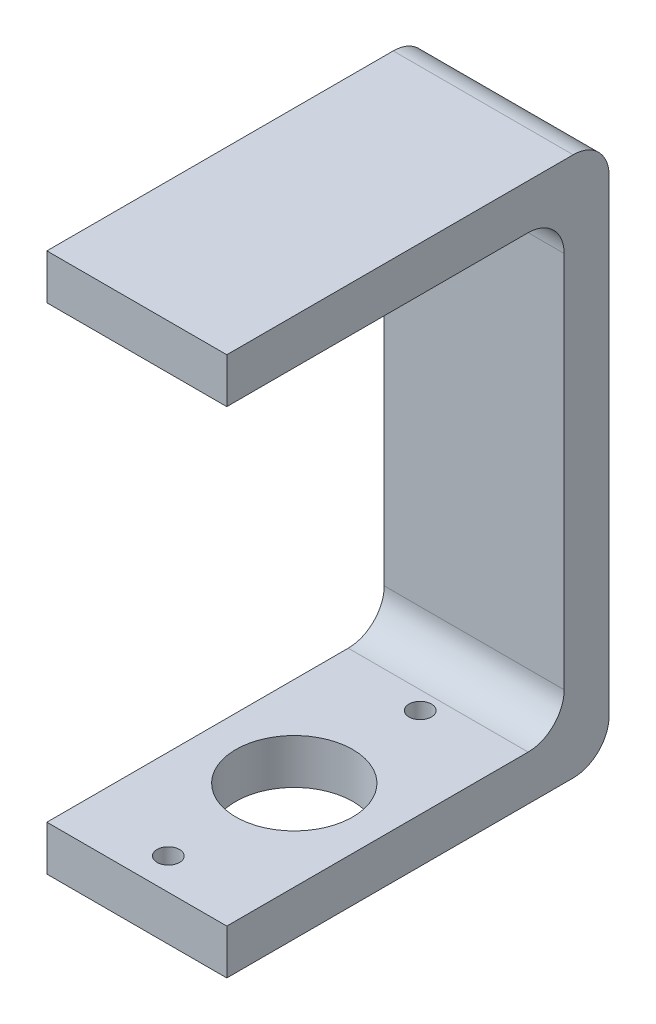
ISO-10303-21;
HEADER;
FILE_DESCRIPTION(('STEP AP214'),'2;1');
FILE_NAME('part.step','',(''),(''),'','','');
FILE_SCHEMA(('AUTOMOTIVE_DESIGN { 1 0 10303 214 1 1 1 1 }'));
ENDSEC;
DATA;
#1=APPLICATION_CONTEXT('core data for automotive mechanical design processes');
#2=APPLICATION_PROTOCOL_DEFINITION('international standard','automotive_design',2000,#1);
#3=PRODUCT_CONTEXT('',#1,'mechanical');
#4=PRODUCT('Part','Part','',(#3));
#5=PRODUCT_RELATED_PRODUCT_CATEGORY('part','',(#4));
#6=PRODUCT_DEFINITION_FORMATION('','',#4);
#7=PRODUCT_DEFINITION_CONTEXT('part definition',#1,'design');
#8=PRODUCT_DEFINITION('design','',#6,#7);
#9=PRODUCT_DEFINITION_SHAPE('','',#8);
#10=(LENGTH_UNIT() NAMED_UNIT(*) SI_UNIT(.MILLI.,.METRE.));
#11=(NAMED_UNIT(*) PLANE_ANGLE_UNIT() SI_UNIT($,.RADIAN.));
#12=(NAMED_UNIT(*) SI_UNIT($,.STERADIAN.) SOLID_ANGLE_UNIT());
#13=UNCERTAINTY_MEASURE_WITH_UNIT(LENGTH_MEASURE(1.E-05),#10,'distance_accuracy_value','');
#14=(GEOMETRIC_REPRESENTATION_CONTEXT(3) GLOBAL_UNCERTAINTY_ASSIGNED_CONTEXT((#13)) GLOBAL_UNIT_ASSIGNED_CONTEXT((#10,
#11,#12)) REPRESENTATION_CONTEXT('',''));
#15=CARTESIAN_POINT('',(0.,0.,0.));
#16=DIRECTION('',(0.,0.,1.));
#17=DIRECTION('',(1.,0.,0.));
#18=AXIS2_PLACEMENT_3D('',#15,#16,#17);
#19=CARTESIAN_POINT('',(40.,0.,0.));
#20=DIRECTION('',(0.,1.,0.));
#21=DIRECTION('',(0.,0.,1.));
#22=AXIS2_PLACEMENT_3D('',#19,#20,#21);
#23=PLANE('',#22);
#24=DIRECTION('',(0.,0.,-1.));
#25=VECTOR('',#24,1.);
#26=CARTESIAN_POINT('',(0.,0.,0.));
#27=LINE('',#26,#25);
#28=CARTESIAN_POINT('',(0.,0.,0.));
#29=VERTEX_POINT('',#28);
#30=CARTESIAN_POINT('',(0.,0.,-77.));
#31=VERTEX_POINT('',#30);
#32=EDGE_CURVE('E158',#29,#31,#27,.T.);
#33=ORIENTED_EDGE('',*,*,#32,.T.);
#34=DIRECTION('',(-1.,0.,0.));
#35=VECTOR('',#34,1.);
#36=CARTESIAN_POINT('',(40.,0.,-77.));
#37=LINE('',#36,#35);
#38=CARTESIAN_POINT('',(40.,0.,-77.));
#39=VERTEX_POINT('',#38);
#40=EDGE_CURVE('E43',#39,#31,#37,.T.);
#41=ORIENTED_EDGE('',*,*,#40,.F.);
#42=DIRECTION('',(0.,0.,-1.));
#43=VECTOR('',#42,1.);
#44=CARTESIAN_POINT('',(40.,0.,0.));
#45=LINE('',#44,#43);
#46=CARTESIAN_POINT('',(40.,0.,0.));
#47=VERTEX_POINT('',#46);
#48=EDGE_CURVE('E106',#47,#39,#45,.T.);
#49=ORIENTED_EDGE('',*,*,#48,.F.);
#50=DIRECTION('',(-1.,0.,0.));
#51=VECTOR('',#50,1.);
#52=CARTESIAN_POINT('',(40.,0.,0.));
#53=LINE('',#52,#51);
#54=EDGE_CURVE('E11',#47,#29,#53,.T.);
#55=ORIENTED_EDGE('',*,*,#54,.T.);
#56=EDGE_LOOP('',(#33,#41,#49,#55));
#57=FACE_BOUND('',#56,.T.);
#58=CARTESIAN_POINT('',(20.,0.,-35.));
#59=DIRECTION('',(0.,-1.,0.));
#60=DIRECTION('',(0.,0.,-1.));
#61=AXIS2_PLACEMENT_3D('',#58,#59,#60);
#62=CIRCLE('',#61,13.);
#63=CARTESIAN_POINT('',(20.,0.,-48.));
#64=VERTEX_POINT('',#63);
#65=EDGE_CURVE('E159',#64,#64,#62,.T.);
#66=ORIENTED_EDGE('',*,*,#65,.F.);
#67=EDGE_LOOP('',(#66));
#68=FACE_BOUND('',#67,.T.);
#69=CARTESIAN_POINT('',(20.,0.,-63.));
#70=DIRECTION('',(0.,-1.,0.));
#71=DIRECTION('',(0.,0.,-1.));
#72=AXIS2_PLACEMENT_3D('',#69,#70,#71);
#73=CIRCLE('',#72,2.5);
#74=CARTESIAN_POINT('',(20.,0.,-65.5));
#75=VERTEX_POINT('',#74);
#76=EDGE_CURVE('E358',#75,#75,#73,.T.);
#77=ORIENTED_EDGE('',*,*,#76,.F.);
#78=EDGE_LOOP('',(#77));
#79=FACE_BOUND('',#78,.T.);
#80=CARTESIAN_POINT('',(20.,0.,-7.00000000000001));
#81=DIRECTION('',(0.,-1.,0.));
#82=DIRECTION('',(0.,0.,-1.));
#83=AXIS2_PLACEMENT_3D('',#80,#81,#82);
#84=CIRCLE('',#83,2.5);
#85=CARTESIAN_POINT('',(20.,0.,-9.50000000000001));
#86=VERTEX_POINT('',#85);
#87=EDGE_CURVE('E355',#86,#86,#84,.T.);
#88=ORIENTED_EDGE('',*,*,#87,.F.);
#89=EDGE_LOOP('',(#88));
#90=FACE_BOUND('',#89,.T.);
#91=ADVANCED_FACE('F34',(#57,#68,#79,#90),#23,.F.);
#92=CARTESIAN_POINT('',(40.,10.,0.));
#93=DIRECTION('',(0.,0.,-1.));
#94=DIRECTION('',(0.,1.,0.));
#95=AXIS2_PLACEMENT_3D('',#92,#93,#94);
#96=PLANE('',#95);
#97=DIRECTION('',(0.,-1.,0.));
#98=VECTOR('',#97,1.);
#99=CARTESIAN_POINT('',(0.,10.,0.));
#100=LINE('',#99,#98);
#101=CARTESIAN_POINT('',(0.,10.,0.));
#102=VERTEX_POINT('',#101);
#103=EDGE_CURVE('E155',#102,#29,#100,.T.);
#104=ORIENTED_EDGE('',*,*,#103,.T.);
#105=ORIENTED_EDGE('',*,*,#54,.F.);
#106=DIRECTION('',(0.,-1.,0.));
#107=VECTOR('',#106,1.);
#108=CARTESIAN_POINT('',(40.,10.,0.));
#109=LINE('',#108,#107);
#110=CARTESIAN_POINT('',(40.,10.,0.));
#111=VERTEX_POINT('',#110);
#112=EDGE_CURVE('E178',#111,#47,#109,.T.);
#113=ORIENTED_EDGE('',*,*,#112,.F.);
#114=DIRECTION('',(-1.,0.,0.));
#115=VECTOR('',#114,1.);
#116=CARTESIAN_POINT('',(40.,10.,0.));
#117=LINE('',#116,#115);
#118=EDGE_CURVE('E151',#111,#102,#117,.T.);
#119=ORIENTED_EDGE('',*,*,#118,.T.);
#120=EDGE_LOOP('',(#104,#105,#113,#119));
#121=FACE_BOUND('',#120,.T.);
#122=ADVANCED_FACE('F36',(#121),#96,.F.);
#123=CARTESIAN_POINT('',(40.,8.,-77.));
#124=DIRECTION('',(-1.,0.,0.));
#125=DIRECTION('',(0.,0.,1.));
#126=AXIS2_PLACEMENT_3D('',#123,#124,#125);
#127=CYLINDRICAL_SURFACE('',#126,8.);
#128=CARTESIAN_POINT('',(0.,8.,-77.));
#129=DIRECTION('',(1.,0.,0.));
#130=DIRECTION('',(0.,0.,1.));
#131=AXIS2_PLACEMENT_3D('',#128,#129,#130);
#132=CIRCLE('',#131,8.);
#133=CARTESIAN_POINT('',(0.,8.,-85.));
#134=VERTEX_POINT('',#133);
#135=EDGE_CURVE('E161',#31,#134,#132,.T.);
#136=ORIENTED_EDGE('',*,*,#135,.T.);
#137=DIRECTION('',(-1.,0.,0.));
#138=VECTOR('',#137,1.);
#139=CARTESIAN_POINT('',(40.,8.,-85.));
#140=LINE('',#139,#138);
#141=CARTESIAN_POINT('',(40.,8.,-85.));
#142=VERTEX_POINT('',#141);
#143=EDGE_CURVE('E197',#142,#134,#140,.T.);
#144=ORIENTED_EDGE('',*,*,#143,.F.);
#145=CARTESIAN_POINT('',(40.,8.,-77.));
#146=DIRECTION('',(1.,0.,0.));
#147=DIRECTION('',(0.,0.,1.));
#148=AXIS2_PLACEMENT_3D('',#145,#146,#147);
#149=CIRCLE('',#148,8.);
#150=EDGE_CURVE('E205',#39,#142,#149,.T.);
#151=ORIENTED_EDGE('',*,*,#150,.F.);
#152=ORIENTED_EDGE('',*,*,#40,.T.);
#153=EDGE_LOOP('',(#136,#144,#151,#152));
#154=FACE_BOUND('',#153,.T.);
#155=ADVANCED_FACE('F203',(#154),#127,.T.);
#156=CARTESIAN_POINT('',(40.,8.,-85.));
#157=DIRECTION('',(0.,0.,1.));
#158=DIRECTION('',(1.,0.,0.));
#159=AXIS2_PLACEMENT_3D('',#156,#157,#158);
#160=PLANE('',#159);
#161=DIRECTION('',(0.,1.,0.));
#162=VECTOR('',#161,1.);
#163=CARTESIAN_POINT('',(0.,8.,-85.));
#164=LINE('',#163,#162);
#165=CARTESIAN_POINT('',(0.,112.,-85.));
#166=VERTEX_POINT('',#165);
#167=EDGE_CURVE('E163',#134,#166,#164,.T.);
#168=ORIENTED_EDGE('',*,*,#167,.T.);
#169=DIRECTION('',(-1.,0.,0.));
#170=VECTOR('',#169,1.);
#171=CARTESIAN_POINT('',(40.,112.,-85.));
#172=LINE('',#171,#170);
#173=CARTESIAN_POINT('',(40.,112.,-85.));
#174=VERTEX_POINT('',#173);
#175=EDGE_CURVE('E194',#174,#166,#172,.T.);
#176=ORIENTED_EDGE('',*,*,#175,.F.);
#177=DIRECTION('',(0.,1.,0.));
#178=VECTOR('',#177,1.);
#179=CARTESIAN_POINT('',(40.,8.,-85.));
#180=LINE('',#179,#178);
#181=EDGE_CURVE('E223',#142,#174,#180,.T.);
#182=ORIENTED_EDGE('',*,*,#181,.F.);
#183=ORIENTED_EDGE('',*,*,#143,.T.);
#184=EDGE_LOOP('',(#168,#176,#182,#183));
#185=FACE_BOUND('',#184,.T.);
#186=ADVANCED_FACE('F214',(#185),#160,.F.);
#187=CARTESIAN_POINT('',(40.,112.,-77.));
#188=DIRECTION('',(-1.,0.,0.));
#189=DIRECTION('',(0.,0.,1.));
#190=AXIS2_PLACEMENT_3D('',#187,#188,#189);
#191=CYLINDRICAL_SURFACE('',#190,8.);
#192=CARTESIAN_POINT('',(0.,112.,-77.));
#193=DIRECTION('',(1.,0.,0.));
#194=DIRECTION('',(0.,0.,-1.));
#195=AXIS2_PLACEMENT_3D('',#192,#193,#194);
#196=CIRCLE('',#195,8.);
#197=CARTESIAN_POINT('',(0.,120.,-77.));
#198=VERTEX_POINT('',#197);
#199=EDGE_CURVE('E165',#166,#198,#196,.T.);
#200=ORIENTED_EDGE('',*,*,#199,.T.);
#201=DIRECTION('',(-1.,0.,0.));
#202=VECTOR('',#201,1.);
#203=CARTESIAN_POINT('',(40.,120.,-77.));
#204=LINE('',#203,#202);
#205=CARTESIAN_POINT('',(40.,120.,-77.));
#206=VERTEX_POINT('',#205);
#207=EDGE_CURVE('E191',#206,#198,#204,.T.);
#208=ORIENTED_EDGE('',*,*,#207,.F.);
#209=CARTESIAN_POINT('',(40.,112.,-77.));
#210=DIRECTION('',(1.,0.,0.));
#211=DIRECTION('',(0.,0.,-1.));
#212=AXIS2_PLACEMENT_3D('',#209,#210,#211);
#213=CIRCLE('',#212,8.);
#214=EDGE_CURVE('E220',#174,#206,#213,.T.);
#215=ORIENTED_EDGE('',*,*,#214,.F.);
#216=ORIENTED_EDGE('',*,*,#175,.T.);
#217=EDGE_LOOP('',(#200,#208,#215,#216));
#218=FACE_BOUND('',#217,.T.);
#219=ADVANCED_FACE('F218',(#218),#191,.T.);
#220=CARTESIAN_POINT('',(40.,120.,-77.));
#221=DIRECTION('',(0.,-1.,0.));
#222=DIRECTION('',(0.,0.,-1.));
#223=AXIS2_PLACEMENT_3D('',#220,#221,#222);
#224=PLANE('',#223);
#225=DIRECTION('',(0.,0.,1.));
#226=VECTOR('',#225,1.);
#227=CARTESIAN_POINT('',(0.,120.,-77.));
#228=LINE('',#227,#226);
#229=CARTESIAN_POINT('',(0.,120.,0.));
#230=VERTEX_POINT('',#229);
#231=EDGE_CURVE('E167',#198,#230,#228,.T.);
#232=ORIENTED_EDGE('',*,*,#231,.T.);
#233=DIRECTION('',(-1.,0.,0.));
#234=VECTOR('',#233,1.);
#235=CARTESIAN_POINT('',(40.,120.,0.));
#236=LINE('',#235,#234);
#237=CARTESIAN_POINT('',(40.,120.,0.));
#238=VERTEX_POINT('',#237);
#239=EDGE_CURVE('E188',#238,#230,#236,.T.);
#240=ORIENTED_EDGE('',*,*,#239,.F.);
#241=DIRECTION('',(0.,0.,1.));
#242=VECTOR('',#241,1.);
#243=CARTESIAN_POINT('',(40.,120.,-77.));
#244=LINE('',#243,#242);
#245=EDGE_CURVE('E222',#206,#238,#244,.T.);
#246=ORIENTED_EDGE('',*,*,#245,.F.);
#247=ORIENTED_EDGE('',*,*,#207,.T.);
#248=EDGE_LOOP('',(#232,#240,#246,#247));
#249=FACE_BOUND('',#248,.T.);
#250=ADVANCED_FACE('F270',(#249),#224,.F.);
#251=CARTESIAN_POINT('',(40.,120.,0.));
#252=DIRECTION('',(0.,0.,-1.));
#253=DIRECTION('',(0.,1.,0.));
#254=AXIS2_PLACEMENT_3D('',#251,#252,#253);
#255=PLANE('',#254);
#256=DIRECTION('',(0.,-1.,0.));
#257=VECTOR('',#256,1.);
#258=CARTESIAN_POINT('',(0.,120.,0.));
#259=LINE('',#258,#257);
#260=CARTESIAN_POINT('',(0.,110.,0.));
#261=VERTEX_POINT('',#260);
#262=EDGE_CURVE('E169',#230,#261,#259,.T.);
#263=ORIENTED_EDGE('',*,*,#262,.T.);
#264=DIRECTION('',(-1.,0.,0.));
#265=VECTOR('',#264,1.);
#266=CARTESIAN_POINT('',(40.,110.,0.));
#267=LINE('',#266,#265);
#268=CARTESIAN_POINT('',(40.,110.,0.));
#269=VERTEX_POINT('',#268);
#270=EDGE_CURVE('E185',#269,#261,#267,.T.);
#271=ORIENTED_EDGE('',*,*,#270,.F.);
#272=DIRECTION('',(0.,-1.,0.));
#273=VECTOR('',#272,1.);
#274=CARTESIAN_POINT('',(40.,120.,0.));
#275=LINE('',#274,#273);
#276=EDGE_CURVE('E225',#238,#269,#275,.T.);
#277=ORIENTED_EDGE('',*,*,#276,.F.);
#278=ORIENTED_EDGE('',*,*,#239,.T.);
#279=EDGE_LOOP('',(#263,#271,#277,#278));
#280=FACE_BOUND('',#279,.T.);
#281=ADVANCED_FACE('F273',(#280),#255,.F.);
#282=CARTESIAN_POINT('',(40.,110.,0.));
#283=DIRECTION('',(0.,1.,0.));
#284=DIRECTION('',(0.,0.,1.));
#285=AXIS2_PLACEMENT_3D('',#282,#283,#284);
#286=PLANE('',#285);
#287=DIRECTION('',(0.,0.,-1.));
#288=VECTOR('',#287,1.);
#289=CARTESIAN_POINT('',(0.,110.,0.));
#290=LINE('',#289,#288);
#291=CARTESIAN_POINT('',(0.,110.,-67.));
#292=VERTEX_POINT('',#291);
#293=EDGE_CURVE('E171',#261,#292,#290,.T.);
#294=ORIENTED_EDGE('',*,*,#293,.T.);
#295=DIRECTION('',(-1.,0.,0.));
#296=VECTOR('',#295,1.);
#297=CARTESIAN_POINT('',(40.,110.,-67.));
#298=LINE('',#297,#296);
#299=CARTESIAN_POINT('',(40.,110.,-67.));
#300=VERTEX_POINT('',#299);
#301=EDGE_CURVE('E182',#300,#292,#298,.T.);
#302=ORIENTED_EDGE('',*,*,#301,.F.);
#303=DIRECTION('',(0.,0.,-1.));
#304=VECTOR('',#303,1.);
#305=CARTESIAN_POINT('',(40.,110.,0.));
#306=LINE('',#305,#304);
#307=EDGE_CURVE('E231',#269,#300,#306,.T.);
#308=ORIENTED_EDGE('',*,*,#307,.F.);
#309=ORIENTED_EDGE('',*,*,#270,.T.);
#310=EDGE_LOOP('',(#294,#302,#308,#309));
#311=FACE_BOUND('',#310,.T.);
#312=ADVANCED_FACE('F237',(#311),#286,.F.);
#313=CARTESIAN_POINT('',(40.,102.,-67.));
#314=DIRECTION('',(-1.,0.,0.));
#315=DIRECTION('',(0.,0.,1.));
#316=AXIS2_PLACEMENT_3D('',#313,#314,#315);
#317=CYLINDRICAL_SURFACE('',#316,8.00000000000001);
#318=CARTESIAN_POINT('',(0.,102.,-67.));
#319=DIRECTION('',(-1.,0.,0.));
#320=DIRECTION('',(0.,0.,-1.));
#321=AXIS2_PLACEMENT_3D('',#318,#319,#320);
#322=CIRCLE('',#321,8.00000000000001);
#323=CARTESIAN_POINT('',(0.,102.,-75.));
#324=VERTEX_POINT('',#323);
#325=EDGE_CURVE('E173',#292,#324,#322,.T.);
#326=ORIENTED_EDGE('',*,*,#325,.T.);
#327=DIRECTION('',(-1.,0.,0.));
#328=VECTOR('',#327,1.);
#329=CARTESIAN_POINT('',(40.,102.,-75.));
#330=LINE('',#329,#328);
#331=CARTESIAN_POINT('',(40.,102.,-75.));
#332=VERTEX_POINT('',#331);
#333=EDGE_CURVE('E146',#332,#324,#330,.T.);
#334=ORIENTED_EDGE('',*,*,#333,.F.);
#335=CARTESIAN_POINT('',(40.,102.,-67.));
#336=DIRECTION('',(-1.,0.,0.));
#337=DIRECTION('',(0.,0.,-1.));
#338=AXIS2_PLACEMENT_3D('',#335,#336,#337);
#339=CIRCLE('',#338,8.00000000000001);
#340=EDGE_CURVE('E137',#300,#332,#339,.T.);
#341=ORIENTED_EDGE('',*,*,#340,.F.);
#342=ORIENTED_EDGE('',*,*,#301,.T.);
#343=EDGE_LOOP('',(#326,#334,#341,#342));
#344=FACE_BOUND('',#343,.T.);
#345=ADVANCED_FACE('F241',(#344),#317,.F.);
#346=CARTESIAN_POINT('',(40.,102.,-75.));
#347=DIRECTION('',(0.,0.,-1.));
#348=DIRECTION('',(0.,1.,0.));
#349=AXIS2_PLACEMENT_3D('',#346,#347,#348);
#350=PLANE('',#349);
#351=DIRECTION('',(0.,-1.,0.));
#352=VECTOR('',#351,1.);
#353=CARTESIAN_POINT('',(0.,102.,-75.));
#354=LINE('',#353,#352);
#355=CARTESIAN_POINT('',(0.,18.,-75.));
#356=VERTEX_POINT('',#355);
#357=EDGE_CURVE('E145',#324,#356,#354,.T.);
#358=ORIENTED_EDGE('',*,*,#357,.T.);
#359=DIRECTION('',(-1.,0.,0.));
#360=VECTOR('',#359,1.);
#361=CARTESIAN_POINT('',(40.,18.,-75.));
#362=LINE('',#361,#360);
#363=CARTESIAN_POINT('',(40.,18.,-75.));
#364=VERTEX_POINT('',#363);
#365=EDGE_CURVE('E142',#364,#356,#362,.T.);
#366=ORIENTED_EDGE('',*,*,#365,.F.);
#367=DIRECTION('',(0.,-1.,0.));
#368=VECTOR('',#367,1.);
#369=CARTESIAN_POINT('',(40.,102.,-75.));
#370=LINE('',#369,#368);
#371=EDGE_CURVE('E131',#332,#364,#370,.T.);
#372=ORIENTED_EDGE('',*,*,#371,.F.);
#373=ORIENTED_EDGE('',*,*,#333,.T.);
#374=EDGE_LOOP('',(#358,#366,#372,#373));
#375=FACE_BOUND('',#374,.T.);
#376=ADVANCED_FACE('F143',(#375),#350,.F.);
#377=CARTESIAN_POINT('',(40.,18.,-67.));
#378=DIRECTION('',(-1.,0.,0.));
#379=DIRECTION('',(0.,0.,1.));
#380=AXIS2_PLACEMENT_3D('',#377,#378,#379);
#381=CYLINDRICAL_SURFACE('',#380,8.);
#382=CARTESIAN_POINT('',(0.,18.,-67.));
#383=DIRECTION('',(-1.,0.,0.));
#384=DIRECTION('',(0.,0.,-1.));
#385=AXIS2_PLACEMENT_3D('',#382,#383,#384);
#386=CIRCLE('',#385,8.);
#387=CARTESIAN_POINT('',(0.,10.,-67.));
#388=VERTEX_POINT('',#387);
#389=EDGE_CURVE('E92',#356,#388,#386,.T.);
#390=ORIENTED_EDGE('',*,*,#389,.T.);
#391=DIRECTION('',(-1.,0.,0.));
#392=VECTOR('',#391,1.);
#393=CARTESIAN_POINT('',(40.,10.,-67.));
#394=LINE('',#393,#392);
#395=CARTESIAN_POINT('',(40.,10.,-67.));
#396=VERTEX_POINT('',#395);
#397=EDGE_CURVE('E147',#396,#388,#394,.T.);
#398=ORIENTED_EDGE('',*,*,#397,.F.);
#399=CARTESIAN_POINT('',(40.,18.,-67.));
#400=DIRECTION('',(-1.,0.,0.));
#401=DIRECTION('',(0.,0.,-1.));
#402=AXIS2_PLACEMENT_3D('',#399,#400,#401);
#403=CIRCLE('',#402,8.);
#404=EDGE_CURVE('E135',#364,#396,#403,.T.);
#405=ORIENTED_EDGE('',*,*,#404,.F.);
#406=ORIENTED_EDGE('',*,*,#365,.T.);
#407=EDGE_LOOP('',(#390,#398,#405,#406));
#408=FACE_BOUND('',#407,.T.);
#409=ADVANCED_FACE('F149',(#408),#381,.F.);
#410=CARTESIAN_POINT('',(40.,10.,-67.));
#411=DIRECTION('',(0.,-1.,0.));
#412=DIRECTION('',(0.,0.,-1.));
#413=AXIS2_PLACEMENT_3D('',#410,#411,#412);
#414=PLANE('',#413);
#415=CARTESIAN_POINT('',(20.,10.,-7.00000000000001));
#416=DIRECTION('',(0.,-1.,0.));
#417=DIRECTION('',(0.,0.,-1.));
#418=AXIS2_PLACEMENT_3D('',#415,#416,#417);
#419=CIRCLE('',#418,2.5);
#420=CARTESIAN_POINT('',(20.,10.,-9.50000000000001));
#421=VERTEX_POINT('',#420);
#422=EDGE_CURVE('E352',#421,#421,#419,.T.);
#423=ORIENTED_EDGE('',*,*,#422,.T.);
#424=EDGE_LOOP('',(#423));
#425=FACE_BOUND('',#424,.T.);
#426=CARTESIAN_POINT('',(20.,10.,-63.));
#427=DIRECTION('',(0.,-1.,0.));
#428=DIRECTION('',(0.,0.,-1.));
#429=AXIS2_PLACEMENT_3D('',#426,#427,#428);
#430=CIRCLE('',#429,2.5);
#431=CARTESIAN_POINT('',(20.,10.,-65.5));
#432=VERTEX_POINT('',#431);
#433=EDGE_CURVE('E363',#432,#432,#430,.T.);
#434=ORIENTED_EDGE('',*,*,#433,.T.);
#435=EDGE_LOOP('',(#434));
#436=FACE_BOUND('',#435,.T.);
#437=CARTESIAN_POINT('',(20.,10.,-35.));
#438=DIRECTION('',(0.,-1.,0.));
#439=DIRECTION('',(0.,0.,-1.));
#440=AXIS2_PLACEMENT_3D('',#437,#438,#439);
#441=CIRCLE('',#440,13.);
#442=CARTESIAN_POINT('',(20.,10.,-48.));
#443=VERTEX_POINT('',#442);
#444=EDGE_CURVE('E366',#443,#443,#441,.F.);
#445=ORIENTED_EDGE('',*,*,#444,.F.);
#446=EDGE_LOOP('',(#445));
#447=FACE_BOUND('',#446,.T.);
#448=DIRECTION('',(0.,0.,1.));
#449=VECTOR('',#448,1.);
#450=CARTESIAN_POINT('',(0.,10.,-67.));
#451=LINE('',#450,#449);
#452=EDGE_CURVE('E98',#388,#102,#451,.T.);
#453=ORIENTED_EDGE('',*,*,#452,.T.);
#454=ORIENTED_EDGE('',*,*,#118,.F.);
#455=DIRECTION('',(0.,0.,1.));
#456=VECTOR('',#455,1.);
#457=CARTESIAN_POINT('',(40.,10.,-67.));
#458=LINE('',#457,#456);
#459=EDGE_CURVE('E51',#396,#111,#458,.T.);
#460=ORIENTED_EDGE('',*,*,#459,.F.);
#461=ORIENTED_EDGE('',*,*,#397,.T.);
#462=EDGE_LOOP('',(#453,#454,#460,#461));
#463=FACE_BOUND('',#462,.T.);
#464=ADVANCED_FACE('F245',(#425,#436,#447,#463),#414,.F.);
#465=CARTESIAN_POINT('',(40.,8.,-77.));
#466=DIRECTION('',(-1.,0.,0.));
#467=DIRECTION('',(0.,0.,1.));
#468=AXIS2_PLACEMENT_3D('',#465,#466,#467);
#469=PLANE('',#468);
#470=ORIENTED_EDGE('',*,*,#112,.T.);
#471=ORIENTED_EDGE('',*,*,#48,.T.);
#472=ORIENTED_EDGE('',*,*,#150,.T.);
#473=ORIENTED_EDGE('',*,*,#181,.T.);
#474=ORIENTED_EDGE('',*,*,#214,.T.);
#475=ORIENTED_EDGE('',*,*,#245,.T.);
#476=ORIENTED_EDGE('',*,*,#276,.T.);
#477=ORIENTED_EDGE('',*,*,#307,.T.);
#478=ORIENTED_EDGE('',*,*,#340,.T.);
#479=ORIENTED_EDGE('',*,*,#371,.T.);
#480=ORIENTED_EDGE('',*,*,#404,.T.);
#481=ORIENTED_EDGE('',*,*,#459,.T.);
#482=EDGE_LOOP('',(#470,#471,#472,#473,#474,#475,#476,#477,#478,#479,#480,#481));
#483=FACE_BOUND('',#482,.T.);
#484=ADVANCED_FACE('F133',(#483),#469,.F.);
#485=CARTESIAN_POINT('',(0.,8.,-77.));
#486=DIRECTION('',(-1.,0.,0.));
#487=DIRECTION('',(0.,0.,1.));
#488=AXIS2_PLACEMENT_3D('',#485,#486,#487);
#489=PLANE('',#488);
#490=ORIENTED_EDGE('',*,*,#103,.F.);
#491=ORIENTED_EDGE('',*,*,#452,.F.);
#492=ORIENTED_EDGE('',*,*,#389,.F.);
#493=ORIENTED_EDGE('',*,*,#357,.F.);
#494=ORIENTED_EDGE('',*,*,#325,.F.);
#495=ORIENTED_EDGE('',*,*,#293,.F.);
#496=ORIENTED_EDGE('',*,*,#262,.F.);
#497=ORIENTED_EDGE('',*,*,#231,.F.);
#498=ORIENTED_EDGE('',*,*,#199,.F.);
#499=ORIENTED_EDGE('',*,*,#167,.F.);
#500=ORIENTED_EDGE('',*,*,#135,.F.);
#501=ORIENTED_EDGE('',*,*,#32,.F.);
#502=EDGE_LOOP('',(#490,#491,#492,#493,#494,#495,#496,#497,#498,#499,#500,#501));
#503=FACE_BOUND('',#502,.T.);
#504=ADVANCED_FACE('F209',(#503),#489,.T.);
#505=CARTESIAN_POINT('',(20.,120.001,-35.));
#506=DIRECTION('',(0.,-1.,0.));
#507=DIRECTION('',(0.,0.,-1.));
#508=AXIS2_PLACEMENT_3D('',#505,#506,#507);
#509=CYLINDRICAL_SURFACE('',#508,13.);
#510=ORIENTED_EDGE('',*,*,#65,.T.);
#511=EDGE_LOOP('',(#510));
#512=FACE_BOUND('',#511,.T.);
#513=ORIENTED_EDGE('',*,*,#444,.T.);
#514=EDGE_LOOP('',(#513));
#515=FACE_BOUND('',#514,.T.);
#516=ADVANCED_FACE('F307',(#512,#515),#509,.F.);
#517=CARTESIAN_POINT('',(20.,0.,-63.));
#518=DIRECTION('',(0.,-1.,0.));
#519=DIRECTION('',(0.,0.,-1.));
#520=AXIS2_PLACEMENT_3D('',#517,#518,#519);
#521=CYLINDRICAL_SURFACE('',#520,2.5);
#522=ORIENTED_EDGE('',*,*,#433,.F.);
#523=EDGE_LOOP('',(#522));
#524=FACE_BOUND('',#523,.T.);
#525=ORIENTED_EDGE('',*,*,#76,.T.);
#526=EDGE_LOOP('',(#525));
#527=FACE_BOUND('',#526,.T.);
#528=ADVANCED_FACE('F314',(#524,#527),#521,.F.);
#529=CARTESIAN_POINT('',(20.,0.,-7.00000000000001));
#530=DIRECTION('',(0.,-1.,0.));
#531=DIRECTION('',(0.,0.,-1.));
#532=AXIS2_PLACEMENT_3D('',#529,#530,#531);
#533=CYLINDRICAL_SURFACE('',#532,2.5);
#534=ORIENTED_EDGE('',*,*,#422,.F.);
#535=EDGE_LOOP('',(#534));
#536=FACE_BOUND('',#535,.T.);
#537=ORIENTED_EDGE('',*,*,#87,.T.);
#538=EDGE_LOOP('',(#537));
#539=FACE_BOUND('',#538,.T.);
#540=ADVANCED_FACE('F333',(#536,#539),#533,.F.);
#541=CLOSED_SHELL('',(#91,#122,#155,#186,#219,#250,#281,#312,#345,#376,#409,#464,#484,#504,#516,
#528,#540));
#542=MANIFOLD_SOLID_BREP('B2',#541);
#543=ADVANCED_BREP_SHAPE_REPRESENTATION('',(#18,#542),#14);
#544=SHAPE_DEFINITION_REPRESENTATION(#9,#543);
ENDSEC;
END-ISO-10303-21;
